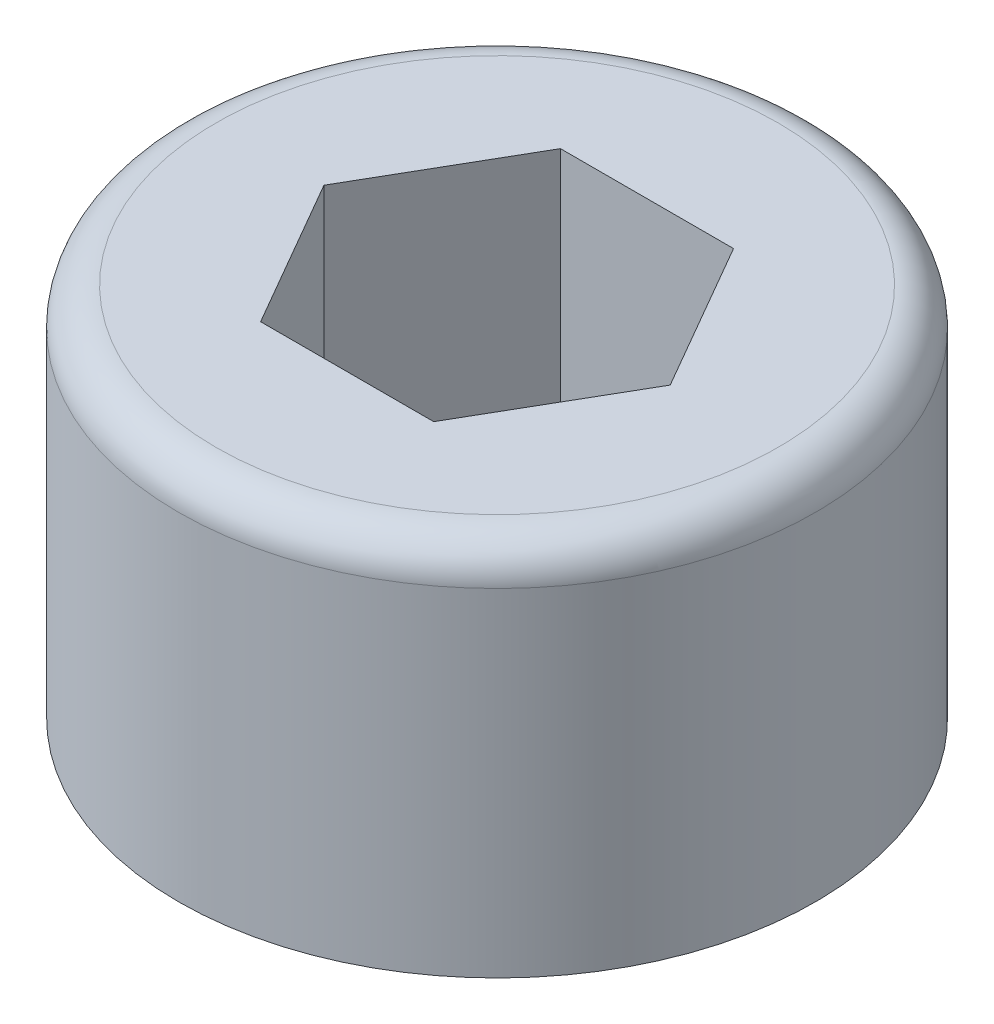
ISO-10303-21;
HEADER;
FILE_DESCRIPTION(('STEP AP214'),'2;1');
FILE_NAME('part.step','',(''),(''),'','','');
FILE_SCHEMA(('AUTOMOTIVE_DESIGN { 1 0 10303 214 1 1 1 1 }'));
ENDSEC;
DATA;
#1=APPLICATION_CONTEXT('core data for automotive mechanical design processes');
#2=APPLICATION_PROTOCOL_DEFINITION('international standard','automotive_design',2000,#1);
#3=PRODUCT_CONTEXT('',#1,'mechanical');
#4=PRODUCT('Part','Part','',(#3));
#5=PRODUCT_RELATED_PRODUCT_CATEGORY('part','',(#4));
#6=PRODUCT_DEFINITION_FORMATION('','',#4);
#7=PRODUCT_DEFINITION_CONTEXT('part definition',#1,'design');
#8=PRODUCT_DEFINITION('design','',#6,#7);
#9=PRODUCT_DEFINITION_SHAPE('','',#8);
#10=(LENGTH_UNIT() NAMED_UNIT(*) SI_UNIT(.MILLI.,.METRE.));
#11=(NAMED_UNIT(*) PLANE_ANGLE_UNIT() SI_UNIT($,.RADIAN.));
#12=(NAMED_UNIT(*) SI_UNIT($,.STERADIAN.) SOLID_ANGLE_UNIT());
#13=UNCERTAINTY_MEASURE_WITH_UNIT(LENGTH_MEASURE(1.E-05),#10,'distance_accuracy_value','');
#14=(GEOMETRIC_REPRESENTATION_CONTEXT(3) GLOBAL_UNCERTAINTY_ASSIGNED_CONTEXT((#13)) GLOBAL_UNIT_ASSIGNED_CONTEXT((#10,
#11,#12)) REPRESENTATION_CONTEXT('',''));
#15=CARTESIAN_POINT('',(0.,0.,0.));
#16=DIRECTION('',(0.,0.,1.));
#17=DIRECTION('',(1.,0.,0.));
#18=AXIS2_PLACEMENT_3D('',#15,#16,#17);
#19=CARTESIAN_POINT('',(0.,5.,0.));
#20=DIRECTION('',(0.,-1.,0.));
#21=DIRECTION('',(0.,0.,-1.));
#22=AXIS2_PLACEMENT_3D('',#19,#20,#21);
#23=CYLINDRICAL_SURFACE('',#22,4.25);
#24=CARTESIAN_POINT('',(0.,4.5,0.));
#25=DIRECTION('',(0.,1.,0.));
#26=DIRECTION('',(0.,0.,1.));
#27=AXIS2_PLACEMENT_3D('',#24,#25,#26);
#28=CIRCLE('',#27,4.25);
#29=CARTESIAN_POINT('',(0.,4.5,4.25));
#30=VERTEX_POINT('',#29);
#31=EDGE_CURVE('E11',#30,#30,#28,.F.);
#32=ORIENTED_EDGE('',*,*,#31,.T.);
#33=EDGE_LOOP('',(#32));
#34=FACE_BOUND('',#33,.T.);
#35=CARTESIAN_POINT('',(0.,0.,0.));
#36=DIRECTION('',(0.,1.,0.));
#37=DIRECTION('',(0.,0.,1.));
#38=AXIS2_PLACEMENT_3D('',#35,#36,#37);
#39=CIRCLE('',#38,4.25);
#40=CARTESIAN_POINT('',(0.,0.,4.25));
#41=VERTEX_POINT('',#40);
#42=EDGE_CURVE('E135',#41,#41,#39,.T.);
#43=ORIENTED_EDGE('',*,*,#42,.T.);
#44=EDGE_LOOP('',(#43));
#45=FACE_BOUND('',#44,.T.);
#46=ADVANCED_FACE('F33',(#34,#45),#23,.T.);
#47=CARTESIAN_POINT('',(0.,5.,0.));
#48=DIRECTION('',(0.,1.,0.));
#49=DIRECTION('',(0.,0.,1.));
#50=AXIS2_PLACEMENT_3D('',#47,#48,#49);
#51=PLANE('',#50);
#52=CARTESIAN_POINT('',(0.,5.,0.));
#53=DIRECTION('',(0.,1.,0.));
#54=DIRECTION('',(0.,0.,1.));
#55=AXIS2_PLACEMENT_3D('',#52,#53,#54);
#56=CIRCLE('',#55,3.75);
#57=CARTESIAN_POINT('',(0.,5.,3.75));
#58=VERTEX_POINT('',#57);
#59=EDGE_CURVE('E41',#58,#58,#56,.T.);
#60=ORIENTED_EDGE('',*,*,#59,.T.);
#61=EDGE_LOOP('',(#60));
#62=FACE_BOUND('',#61,.T.);
#63=DIRECTION('',(-0.5,0.,0.866025403784439));
#64=VECTOR('',#63,1.);
#65=CARTESIAN_POINT('',(-1.15470053837925,5.,-2.));
#66=LINE('',#65,#64);
#67=CARTESIAN_POINT('',(-1.15470053837925,5.,-2.));
#68=VERTEX_POINT('',#67);
#69=CARTESIAN_POINT('',(-2.3094010767585,5.,0.));
#70=VERTEX_POINT('',#69);
#71=EDGE_CURVE('E48',#68,#70,#66,.T.);
#72=ORIENTED_EDGE('',*,*,#71,.F.);
#73=DIRECTION('',(-1.,0.,0.));
#74=VECTOR('',#73,1.);
#75=CARTESIAN_POINT('',(1.15470053837925,5.,-2.));
#76=LINE('',#75,#74);
#77=CARTESIAN_POINT('',(1.15470053837925,5.,-2.));
#78=VERTEX_POINT('',#77);
#79=EDGE_CURVE('E131',#78,#68,#76,.T.);
#80=ORIENTED_EDGE('',*,*,#79,.F.);
#81=DIRECTION('',(-0.5,0.,-0.866025403784438));
#82=VECTOR('',#81,1.);
#83=CARTESIAN_POINT('',(2.3094010767585,5.,0.));
#84=LINE('',#83,#82);
#85=CARTESIAN_POINT('',(2.3094010767585,5.,0.));
#86=VERTEX_POINT('',#85);
#87=EDGE_CURVE('E129',#86,#78,#84,.T.);
#88=ORIENTED_EDGE('',*,*,#87,.F.);
#89=DIRECTION('',(0.5,0.,-0.866025403784439));
#90=VECTOR('',#89,1.);
#91=CARTESIAN_POINT('',(1.15470053837925,5.,2.));
#92=LINE('',#91,#90);
#93=CARTESIAN_POINT('',(1.15470053837925,5.,2.));
#94=VERTEX_POINT('',#93);
#95=EDGE_CURVE('E96',#94,#86,#92,.T.);
#96=ORIENTED_EDGE('',*,*,#95,.F.);
#97=DIRECTION('',(1.,0.,0.));
#98=VECTOR('',#97,1.);
#99=CARTESIAN_POINT('',(-1.15470053837925,5.,2.));
#100=LINE('',#99,#98);
#101=CARTESIAN_POINT('',(-1.15470053837925,5.,2.));
#102=VERTEX_POINT('',#101);
#103=EDGE_CURVE('E125',#102,#94,#100,.T.);
#104=ORIENTED_EDGE('',*,*,#103,.F.);
#105=DIRECTION('',(0.5,0.,0.866025403784439));
#106=VECTOR('',#105,1.);
#107=CARTESIAN_POINT('',(-2.3094010767585,5.,0.));
#108=LINE('',#107,#106);
#109=EDGE_CURVE('E122',#70,#102,#108,.T.);
#110=ORIENTED_EDGE('',*,*,#109,.F.);
#111=EDGE_LOOP('',(#72,#80,#88,#96,#104,#110));
#112=FACE_BOUND('',#111,.T.);
#113=ADVANCED_FACE('F145',(#62,#112),#51,.T.);
#114=CARTESIAN_POINT('',(0.,0.,0.));
#115=DIRECTION('',(0.,1.,0.));
#116=DIRECTION('',(0.,0.,1.));
#117=AXIS2_PLACEMENT_3D('',#114,#115,#116);
#118=PLANE('',#117);
#119=ORIENTED_EDGE('',*,*,#42,.F.);
#120=EDGE_LOOP('',(#119));
#121=FACE_BOUND('',#120,.T.);
#122=ADVANCED_FACE('F161',(#121),#118,.F.);
#123=CARTESIAN_POINT('',(-1.15470053837925,2.,-2.));
#124=DIRECTION('',(-0.866025403784439,0.,-0.5));
#125=DIRECTION('',(-0.5,0.,0.866025403784439));
#126=AXIS2_PLACEMENT_3D('',#123,#124,#125);
#127=PLANE('',#126);
#128=ORIENTED_EDGE('',*,*,#71,.T.);
#129=DIRECTION('',(0.,1.,0.));
#130=VECTOR('',#129,1.);
#131=CARTESIAN_POINT('',(-2.3094010767585,2.,0.));
#132=LINE('',#131,#130);
#133=CARTESIAN_POINT('',(-2.3094010767585,2.,0.));
#134=VERTEX_POINT('',#133);
#135=EDGE_CURVE('E78',#134,#70,#132,.T.);
#136=ORIENTED_EDGE('',*,*,#135,.F.);
#137=DIRECTION('',(-0.5,0.,0.866025403784439));
#138=VECTOR('',#137,1.);
#139=CARTESIAN_POINT('',(-1.15470053837925,2.,-2.));
#140=LINE('',#139,#138);
#141=CARTESIAN_POINT('',(-1.15470053837925,2.,-2.));
#142=VERTEX_POINT('',#141);
#143=EDGE_CURVE('E133',#142,#134,#140,.T.);
#144=ORIENTED_EDGE('',*,*,#143,.F.);
#145=DIRECTION('',(0.,1.,0.));
#146=VECTOR('',#145,1.);
#147=CARTESIAN_POINT('',(-1.15470053837925,2.,-2.));
#148=LINE('',#147,#146);
#149=EDGE_CURVE('E56',#142,#68,#148,.T.);
#150=ORIENTED_EDGE('',*,*,#149,.T.);
#151=EDGE_LOOP('',(#128,#136,#144,#150));
#152=FACE_BOUND('',#151,.T.);
#153=ADVANCED_FACE('F166',(#152),#127,.F.);
#154=CARTESIAN_POINT('',(1.15470053837925,2.,-2.));
#155=DIRECTION('',(0.,0.,-1.));
#156=DIRECTION('',(-1.,0.,0.));
#157=AXIS2_PLACEMENT_3D('',#154,#155,#156);
#158=PLANE('',#157);
#159=ORIENTED_EDGE('',*,*,#79,.T.);
#160=ORIENTED_EDGE('',*,*,#149,.F.);
#161=DIRECTION('',(-1.,0.,0.));
#162=VECTOR('',#161,1.);
#163=CARTESIAN_POINT('',(1.15470053837925,2.,-2.));
#164=LINE('',#163,#162);
#165=CARTESIAN_POINT('',(1.15470053837925,2.,-2.));
#166=VERTEX_POINT('',#165);
#167=EDGE_CURVE('E108',#166,#142,#164,.T.);
#168=ORIENTED_EDGE('',*,*,#167,.F.);
#169=DIRECTION('',(0.,1.,0.));
#170=VECTOR('',#169,1.);
#171=CARTESIAN_POINT('',(1.15470053837925,2.,-2.));
#172=LINE('',#171,#170);
#173=EDGE_CURVE('E100',#166,#78,#172,.T.);
#174=ORIENTED_EDGE('',*,*,#173,.T.);
#175=EDGE_LOOP('',(#159,#160,#168,#174));
#176=FACE_BOUND('',#175,.T.);
#177=ADVANCED_FACE('F171',(#176),#158,.F.);
#178=CARTESIAN_POINT('',(2.3094010767585,2.,0.));
#179=DIRECTION('',(0.866025403784438,0.,-0.5));
#180=DIRECTION('',(-0.5,0.,-0.866025403784439));
#181=AXIS2_PLACEMENT_3D('',#178,#179,#180);
#182=PLANE('',#181);
#183=ORIENTED_EDGE('',*,*,#87,.T.);
#184=ORIENTED_EDGE('',*,*,#173,.F.);
#185=DIRECTION('',(-0.5,0.,-0.866025403784438));
#186=VECTOR('',#185,1.);
#187=CARTESIAN_POINT('',(2.3094010767585,2.,0.));
#188=LINE('',#187,#186);
#189=CARTESIAN_POINT('',(2.3094010767585,2.,0.));
#190=VERTEX_POINT('',#189);
#191=EDGE_CURVE('E104',#190,#166,#188,.T.);
#192=ORIENTED_EDGE('',*,*,#191,.F.);
#193=DIRECTION('',(0.,1.,0.));
#194=VECTOR('',#193,1.);
#195=CARTESIAN_POINT('',(2.3094010767585,2.,0.));
#196=LINE('',#195,#194);
#197=EDGE_CURVE('E89',#190,#86,#196,.T.);
#198=ORIENTED_EDGE('',*,*,#197,.T.);
#199=EDGE_LOOP('',(#183,#184,#192,#198));
#200=FACE_BOUND('',#199,.T.);
#201=ADVANCED_FACE('F105',(#200),#182,.F.);
#202=CARTESIAN_POINT('',(1.15470053837925,2.,2.));
#203=DIRECTION('',(0.866025403784439,0.,0.5));
#204=DIRECTION('',(0.5,0.,-0.866025403784439));
#205=AXIS2_PLACEMENT_3D('',#202,#203,#204);
#206=PLANE('',#205);
#207=ORIENTED_EDGE('',*,*,#95,.T.);
#208=ORIENTED_EDGE('',*,*,#197,.F.);
#209=DIRECTION('',(0.5,0.,-0.866025403784439));
#210=VECTOR('',#209,1.);
#211=CARTESIAN_POINT('',(1.15470053837925,2.,2.));
#212=LINE('',#211,#210);
#213=CARTESIAN_POINT('',(1.15470053837925,2.,2.));
#214=VERTEX_POINT('',#213);
#215=EDGE_CURVE('E93',#214,#190,#212,.T.);
#216=ORIENTED_EDGE('',*,*,#215,.F.);
#217=DIRECTION('',(0.,1.,0.));
#218=VECTOR('',#217,1.);
#219=CARTESIAN_POINT('',(1.15470053837925,2.,2.));
#220=LINE('',#219,#218);
#221=EDGE_CURVE('E101',#214,#94,#220,.T.);
#222=ORIENTED_EDGE('',*,*,#221,.T.);
#223=EDGE_LOOP('',(#207,#208,#216,#222));
#224=FACE_BOUND('',#223,.T.);
#225=ADVANCED_FACE('F91',(#224),#206,.F.);
#226=CARTESIAN_POINT('',(-1.15470053837925,2.,2.));
#227=DIRECTION('',(0.,0.,1.));
#228=DIRECTION('',(1.,0.,0.));
#229=AXIS2_PLACEMENT_3D('',#226,#227,#228);
#230=PLANE('',#229);
#231=ORIENTED_EDGE('',*,*,#103,.T.);
#232=ORIENTED_EDGE('',*,*,#221,.F.);
#233=DIRECTION('',(1.,0.,0.));
#234=VECTOR('',#233,1.);
#235=CARTESIAN_POINT('',(-1.15470053837925,2.,2.));
#236=LINE('',#235,#234);
#237=CARTESIAN_POINT('',(-1.15470053837925,2.,2.));
#238=VERTEX_POINT('',#237);
#239=EDGE_CURVE('E114',#238,#214,#236,.T.);
#240=ORIENTED_EDGE('',*,*,#239,.F.);
#241=DIRECTION('',(0.,1.,0.));
#242=VECTOR('',#241,1.);
#243=CARTESIAN_POINT('',(-1.15470053837925,2.,2.));
#244=LINE('',#243,#242);
#245=EDGE_CURVE('E138',#238,#102,#244,.T.);
#246=ORIENTED_EDGE('',*,*,#245,.T.);
#247=EDGE_LOOP('',(#231,#232,#240,#246));
#248=FACE_BOUND('',#247,.T.);
#249=ADVANCED_FACE('F174',(#248),#230,.F.);
#250=CARTESIAN_POINT('',(-2.3094010767585,2.,0.));
#251=DIRECTION('',(-0.866025403784438,0.,0.5));
#252=DIRECTION('',(0.5,0.,0.866025403784439));
#253=AXIS2_PLACEMENT_3D('',#250,#251,#252);
#254=PLANE('',#253);
#255=ORIENTED_EDGE('',*,*,#109,.T.);
#256=ORIENTED_EDGE('',*,*,#245,.F.);
#257=DIRECTION('',(0.5,0.,0.866025403784439));
#258=VECTOR('',#257,1.);
#259=CARTESIAN_POINT('',(-2.3094010767585,2.,0.));
#260=LINE('',#259,#258);
#261=EDGE_CURVE('E116',#134,#238,#260,.T.);
#262=ORIENTED_EDGE('',*,*,#261,.F.);
#263=ORIENTED_EDGE('',*,*,#135,.T.);
#264=EDGE_LOOP('',(#255,#256,#262,#263));
#265=FACE_BOUND('',#264,.T.);
#266=ADVANCED_FACE('F153',(#265),#254,.F.);
#267=CARTESIAN_POINT('',(0.,2.,0.));
#268=DIRECTION('',(0.,1.,0.));
#269=DIRECTION('',(0.,0.,1.));
#270=AXIS2_PLACEMENT_3D('',#267,#268,#269);
#271=PLANE('',#270);
#272=ORIENTED_EDGE('',*,*,#143,.T.);
#273=ORIENTED_EDGE('',*,*,#261,.T.);
#274=ORIENTED_EDGE('',*,*,#239,.T.);
#275=ORIENTED_EDGE('',*,*,#215,.T.);
#276=ORIENTED_EDGE('',*,*,#191,.T.);
#277=ORIENTED_EDGE('',*,*,#167,.T.);
#278=EDGE_LOOP('',(#272,#273,#274,#275,#276,#277));
#279=FACE_BOUND('',#278,.T.);
#280=ADVANCED_FACE('F111',(#279),#271,.T.);
#281=CARTESIAN_POINT('',(0.,4.5,0.));
#282=DIRECTION('',(0.,1.,0.));
#283=DIRECTION('',(0.,0.,1.));
#284=AXIS2_PLACEMENT_3D('',#281,#282,#283);
#285=TOROIDAL_SURFACE('',#284,3.75,0.5);
#286=ORIENTED_EDGE('',*,*,#31,.F.);
#287=EDGE_LOOP('',(#286));
#288=FACE_BOUND('',#287,.T.);
#289=ORIENTED_EDGE('',*,*,#59,.F.);
#290=EDGE_LOOP('',(#289));
#291=FACE_BOUND('',#290,.T.);
#292=ADVANCED_FACE('F35',(#288,#291),#285,.T.);
#293=CLOSED_SHELL('',(#46,#113,#122,#153,#177,#201,#225,#249,#266,#280,#292));
#294=MANIFOLD_SOLID_BREP('B2',#293);
#295=ADVANCED_BREP_SHAPE_REPRESENTATION('',(#18,#294),#14);
#296=SHAPE_DEFINITION_REPRESENTATION(#9,#295);
ENDSEC;
END-ISO-10303-21;
